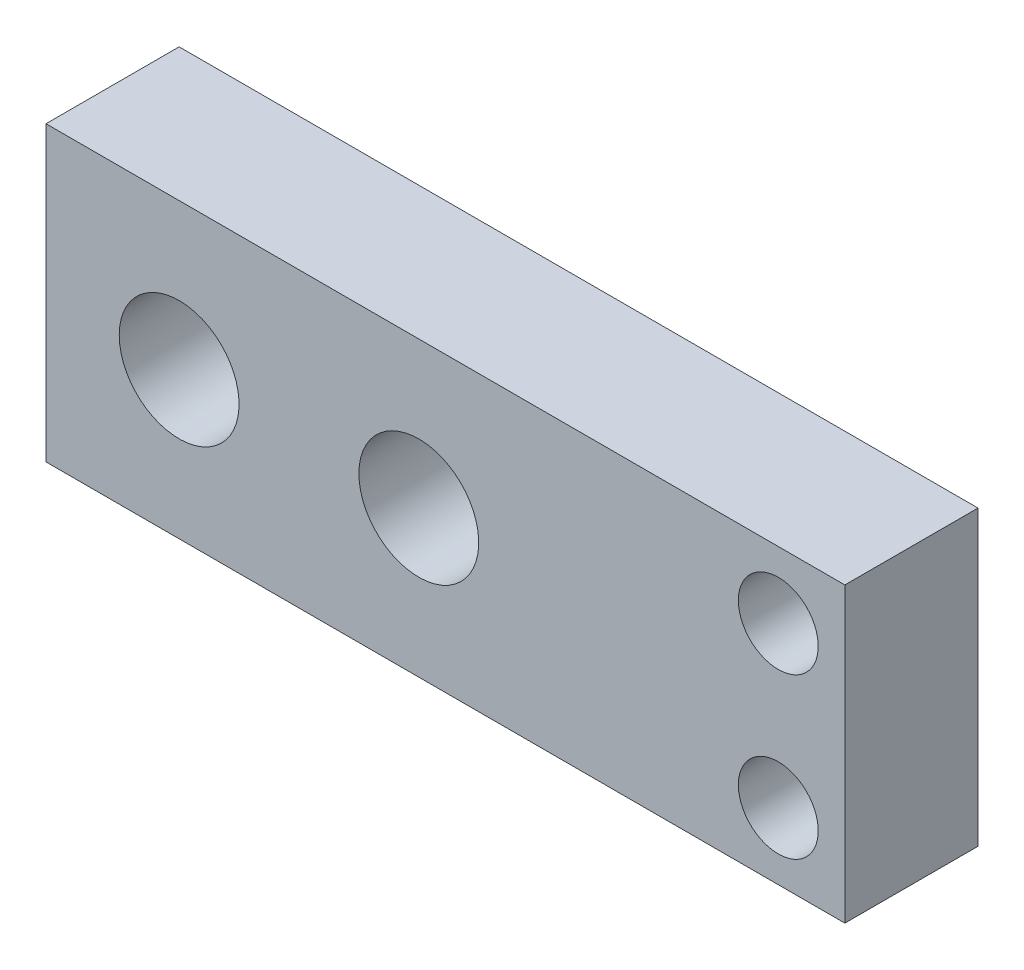
ISO-10303-21;
HEADER;
FILE_DESCRIPTION(('STEP AP214'),'2;1');
FILE_NAME('part.step','',(''),(''),'','','');
FILE_SCHEMA(('AUTOMOTIVE_DESIGN { 1 0 10303 214 1 1 1 1 }'));
ENDSEC;
DATA;
#1=APPLICATION_CONTEXT('core data for automotive mechanical design processes');
#2=APPLICATION_PROTOCOL_DEFINITION('international standard','automotive_design',2000,#1);
#3=PRODUCT_CONTEXT('',#1,'mechanical');
#4=PRODUCT('Part','Part','',(#3));
#5=PRODUCT_RELATED_PRODUCT_CATEGORY('part','',(#4));
#6=PRODUCT_DEFINITION_FORMATION('','',#4);
#7=PRODUCT_DEFINITION_CONTEXT('part definition',#1,'design');
#8=PRODUCT_DEFINITION('design','',#6,#7);
#9=PRODUCT_DEFINITION_SHAPE('','',#8);
#10=(LENGTH_UNIT() NAMED_UNIT(*) SI_UNIT(.MILLI.,.METRE.));
#11=(NAMED_UNIT(*) PLANE_ANGLE_UNIT() SI_UNIT($,.RADIAN.));
#12=(NAMED_UNIT(*) SI_UNIT($,.STERADIAN.) SOLID_ANGLE_UNIT());
#13=UNCERTAINTY_MEASURE_WITH_UNIT(LENGTH_MEASURE(1.E-05),#10,'distance_accuracy_value','');
#14=(GEOMETRIC_REPRESENTATION_CONTEXT(3) GLOBAL_UNCERTAINTY_ASSIGNED_CONTEXT((#13)) GLOBAL_UNIT_ASSIGNED_CONTEXT((#10,
#11,#12)) REPRESENTATION_CONTEXT('',''));
#15=CARTESIAN_POINT('',(0.,0.,0.));
#16=DIRECTION('',(0.,0.,1.));
#17=DIRECTION('',(1.,0.,0.));
#18=AXIS2_PLACEMENT_3D('',#15,#16,#17);
#19=CARTESIAN_POINT('',(30.,-11.,10.));
#20=DIRECTION('',(-1.,0.,0.));
#21=DIRECTION('',(0.,0.,1.));
#22=AXIS2_PLACEMENT_3D('',#19,#20,#21);
#23=PLANE('',#22);
#24=DIRECTION('',(0.,1.,0.));
#25=VECTOR('',#24,1.);
#26=CARTESIAN_POINT('',(30.,-11.,0.));
#27=LINE('',#26,#25);
#28=CARTESIAN_POINT('',(30.,-11.,0.));
#29=VERTEX_POINT('',#28);
#30=CARTESIAN_POINT('',(30.,11.,0.));
#31=VERTEX_POINT('',#30);
#32=EDGE_CURVE('E95',#29,#31,#27,.T.);
#33=ORIENTED_EDGE('',*,*,#32,.T.);
#34=DIRECTION('',(0.,0.,-1.));
#35=VECTOR('',#34,1.);
#36=CARTESIAN_POINT('',(30.,11.,10.));
#37=LINE('',#36,#35);
#38=CARTESIAN_POINT('',(30.,11.,10.));
#39=VERTEX_POINT('',#38);
#40=EDGE_CURVE('E11',#39,#31,#37,.T.);
#41=ORIENTED_EDGE('',*,*,#40,.F.);
#42=DIRECTION('',(0.,1.,0.));
#43=VECTOR('',#42,1.);
#44=CARTESIAN_POINT('',(30.,-11.,10.));
#45=LINE('',#44,#43);
#46=CARTESIAN_POINT('',(30.,-11.,10.));
#47=VERTEX_POINT('',#46);
#48=EDGE_CURVE('E83',#47,#39,#45,.T.);
#49=ORIENTED_EDGE('',*,*,#48,.F.);
#50=DIRECTION('',(0.,0.,-1.));
#51=VECTOR('',#50,1.);
#52=CARTESIAN_POINT('',(30.,-11.,10.));
#53=LINE('',#52,#51);
#54=EDGE_CURVE('E91',#47,#29,#53,.T.);
#55=ORIENTED_EDGE('',*,*,#54,.T.);
#56=EDGE_LOOP('',(#33,#41,#49,#55));
#57=FACE_BOUND('',#56,.T.);
#58=ADVANCED_FACE('F32',(#57),#23,.F.);
#59=CARTESIAN_POINT('',(-30.,11.,10.));
#60=DIRECTION('',(0.,-1.,0.));
#61=DIRECTION('',(0.,0.,-1.));
#62=AXIS2_PLACEMENT_3D('',#59,#60,#61);
#63=PLANE('',#62);
#64=DIRECTION('',(-1.,0.,0.));
#65=VECTOR('',#64,1.);
#66=CARTESIAN_POINT('',(-30.,11.,0.));
#67=LINE('',#66,#65);
#68=CARTESIAN_POINT('',(-30.,11.,0.));
#69=VERTEX_POINT('',#68);
#70=EDGE_CURVE('E87',#31,#69,#67,.T.);
#71=ORIENTED_EDGE('',*,*,#70,.T.);
#72=DIRECTION('',(0.,0.,-1.));
#73=VECTOR('',#72,1.);
#74=CARTESIAN_POINT('',(-30.,11.,10.));
#75=LINE('',#74,#73);
#76=CARTESIAN_POINT('',(-30.,11.,10.));
#77=VERTEX_POINT('',#76);
#78=EDGE_CURVE('E40',#77,#69,#75,.T.);
#79=ORIENTED_EDGE('',*,*,#78,.F.);
#80=DIRECTION('',(-1.,0.,0.));
#81=VECTOR('',#80,1.);
#82=CARTESIAN_POINT('',(-30.,11.,10.));
#83=LINE('',#82,#81);
#84=EDGE_CURVE('E78',#39,#77,#83,.T.);
#85=ORIENTED_EDGE('',*,*,#84,.F.);
#86=ORIENTED_EDGE('',*,*,#40,.T.);
#87=EDGE_LOOP('',(#71,#79,#85,#86));
#88=FACE_BOUND('',#87,.T.);
#89=ADVANCED_FACE('F86',(#88),#63,.F.);
#90=CARTESIAN_POINT('',(-30.,-11.,10.));
#91=DIRECTION('',(1.,0.,0.));
#92=DIRECTION('',(0.,0.,-1.));
#93=AXIS2_PLACEMENT_3D('',#90,#91,#92);
#94=PLANE('',#93);
#95=DIRECTION('',(0.,-1.,0.));
#96=VECTOR('',#95,1.);
#97=CARTESIAN_POINT('',(-30.,-11.,0.));
#98=LINE('',#97,#96);
#99=CARTESIAN_POINT('',(-30.,-11.,0.));
#100=VERTEX_POINT('',#99);
#101=EDGE_CURVE('E65',#69,#100,#98,.T.);
#102=ORIENTED_EDGE('',*,*,#101,.T.);
#103=DIRECTION('',(0.,0.,-1.));
#104=VECTOR('',#103,1.);
#105=CARTESIAN_POINT('',(-30.,-11.,10.));
#106=LINE('',#105,#104);
#107=CARTESIAN_POINT('',(-30.,-11.,10.));
#108=VERTEX_POINT('',#107);
#109=EDGE_CURVE('E88',#108,#100,#106,.T.);
#110=ORIENTED_EDGE('',*,*,#109,.F.);
#111=DIRECTION('',(0.,-1.,0.));
#112=VECTOR('',#111,1.);
#113=CARTESIAN_POINT('',(-30.,-11.,10.));
#114=LINE('',#113,#112);
#115=EDGE_CURVE('E81',#77,#108,#114,.T.);
#116=ORIENTED_EDGE('',*,*,#115,.F.);
#117=ORIENTED_EDGE('',*,*,#78,.T.);
#118=EDGE_LOOP('',(#102,#110,#116,#117));
#119=FACE_BOUND('',#118,.T.);
#120=ADVANCED_FACE('F89',(#119),#94,.F.);
#121=CARTESIAN_POINT('',(-30.,-11.,10.));
#122=DIRECTION('',(0.,1.,0.));
#123=DIRECTION('',(0.,0.,1.));
#124=AXIS2_PLACEMENT_3D('',#121,#122,#123);
#125=PLANE('',#124);
#126=DIRECTION('',(1.,0.,0.));
#127=VECTOR('',#126,1.);
#128=CARTESIAN_POINT('',(-30.,-11.,0.));
#129=LINE('',#128,#127);
#130=EDGE_CURVE('E71',#100,#29,#129,.T.);
#131=ORIENTED_EDGE('',*,*,#130,.T.);
#132=ORIENTED_EDGE('',*,*,#54,.F.);
#133=DIRECTION('',(1.,0.,0.));
#134=VECTOR('',#133,1.);
#135=CARTESIAN_POINT('',(-30.,-11.,10.));
#136=LINE('',#135,#134);
#137=EDGE_CURVE('E48',#108,#47,#136,.T.);
#138=ORIENTED_EDGE('',*,*,#137,.F.);
#139=ORIENTED_EDGE('',*,*,#109,.T.);
#140=EDGE_LOOP('',(#131,#132,#138,#139));
#141=FACE_BOUND('',#140,.T.);
#142=ADVANCED_FACE('F103',(#141),#125,.F.);
#143=CARTESIAN_POINT('',(0.,0.,10.));
#144=DIRECTION('',(0.,0.,-1.));
#145=DIRECTION('',(-1.,0.,0.));
#146=AXIS2_PLACEMENT_3D('',#143,#144,#145);
#147=PLANE('',#146);
#148=CARTESIAN_POINT('',(25.,-6.,10.));
#149=DIRECTION('',(0.,0.,-1.));
#150=DIRECTION('',(-1.,0.,0.));
#151=AXIS2_PLACEMENT_3D('',#148,#149,#150);
#152=CIRCLE('',#151,3.);
#153=CARTESIAN_POINT('',(22.,-6.,10.));
#154=VERTEX_POINT('',#153);
#155=EDGE_CURVE('E126',#154,#154,#152,.T.);
#156=ORIENTED_EDGE('',*,*,#155,.T.);
#157=EDGE_LOOP('',(#156));
#158=FACE_BOUND('',#157,.T.);
#159=CARTESIAN_POINT('',(25.,6.,10.));
#160=DIRECTION('',(0.,0.,-1.));
#161=DIRECTION('',(-1.,0.,0.));
#162=AXIS2_PLACEMENT_3D('',#159,#160,#161);
#163=CIRCLE('',#162,3.);
#164=CARTESIAN_POINT('',(22.,6.,10.));
#165=VERTEX_POINT('',#164);
#166=EDGE_CURVE('E120',#165,#165,#163,.T.);
#167=ORIENTED_EDGE('',*,*,#166,.T.);
#168=EDGE_LOOP('',(#167));
#169=FACE_BOUND('',#168,.T.);
#170=CARTESIAN_POINT('',(-1.99999999999999,0.,10.));
#171=DIRECTION('',(0.,0.,-1.));
#172=DIRECTION('',(-1.,0.,0.));
#173=AXIS2_PLACEMENT_3D('',#170,#171,#172);
#174=CIRCLE('',#173,4.5);
#175=CARTESIAN_POINT('',(-6.49999999999999,0.,10.));
#176=VERTEX_POINT('',#175);
#177=EDGE_CURVE('E114',#176,#176,#174,.T.);
#178=ORIENTED_EDGE('',*,*,#177,.T.);
#179=EDGE_LOOP('',(#178));
#180=FACE_BOUND('',#179,.T.);
#181=CARTESIAN_POINT('',(-20.,0.,10.));
#182=DIRECTION('',(0.,0.,-1.));
#183=DIRECTION('',(-1.,0.,0.));
#184=AXIS2_PLACEMENT_3D('',#181,#182,#183);
#185=CIRCLE('',#184,4.5);
#186=CARTESIAN_POINT('',(-24.5,0.,10.));
#187=VERTEX_POINT('',#186);
#188=EDGE_CURVE('E98',#187,#187,#185,.T.);
#189=ORIENTED_EDGE('',*,*,#188,.T.);
#190=EDGE_LOOP('',(#189));
#191=FACE_BOUND('',#190,.T.);
#192=ORIENTED_EDGE('',*,*,#48,.T.);
#193=ORIENTED_EDGE('',*,*,#84,.T.);
#194=ORIENTED_EDGE('',*,*,#115,.T.);
#195=ORIENTED_EDGE('',*,*,#137,.T.);
#196=EDGE_LOOP('',(#192,#193,#194,#195));
#197=FACE_BOUND('',#196,.T.);
#198=ADVANCED_FACE('F79',(#158,#169,#180,#191,#197),#147,.F.);
#199=CARTESIAN_POINT('',(0.,0.,0.));
#200=DIRECTION('',(0.,0.,-1.));
#201=DIRECTION('',(-1.,0.,0.));
#202=AXIS2_PLACEMENT_3D('',#199,#200,#201);
#203=PLANE('',#202);
#204=CARTESIAN_POINT('',(25.,-6.,0.));
#205=DIRECTION('',(0.,0.,-1.));
#206=DIRECTION('',(-1.,0.,0.));
#207=AXIS2_PLACEMENT_3D('',#204,#205,#206);
#208=CIRCLE('',#207,3.);
#209=CARTESIAN_POINT('',(22.,-6.,0.));
#210=VERTEX_POINT('',#209);
#211=EDGE_CURVE('E129',#210,#210,#208,.T.);
#212=ORIENTED_EDGE('',*,*,#211,.F.);
#213=EDGE_LOOP('',(#212));
#214=FACE_BOUND('',#213,.T.);
#215=CARTESIAN_POINT('',(25.,6.,0.));
#216=DIRECTION('',(0.,0.,-1.));
#217=DIRECTION('',(-1.,0.,0.));
#218=AXIS2_PLACEMENT_3D('',#215,#216,#217);
#219=CIRCLE('',#218,3.);
#220=CARTESIAN_POINT('',(22.,6.,0.));
#221=VERTEX_POINT('',#220);
#222=EDGE_CURVE('E123',#221,#221,#219,.T.);
#223=ORIENTED_EDGE('',*,*,#222,.F.);
#224=EDGE_LOOP('',(#223));
#225=FACE_BOUND('',#224,.T.);
#226=CARTESIAN_POINT('',(-1.99999999999999,0.,0.));
#227=DIRECTION('',(0.,0.,-1.));
#228=DIRECTION('',(-1.,0.,0.));
#229=AXIS2_PLACEMENT_3D('',#226,#227,#228);
#230=CIRCLE('',#229,4.5);
#231=CARTESIAN_POINT('',(-6.49999999999999,0.,0.));
#232=VERTEX_POINT('',#231);
#233=EDGE_CURVE('E117',#232,#232,#230,.T.);
#234=ORIENTED_EDGE('',*,*,#233,.F.);
#235=EDGE_LOOP('',(#234));
#236=FACE_BOUND('',#235,.T.);
#237=CARTESIAN_POINT('',(-20.,0.,0.));
#238=DIRECTION('',(0.,0.,-1.));
#239=DIRECTION('',(-1.,0.,0.));
#240=AXIS2_PLACEMENT_3D('',#237,#238,#239);
#241=CIRCLE('',#240,4.5);
#242=CARTESIAN_POINT('',(-24.5,0.,0.));
#243=VERTEX_POINT('',#242);
#244=EDGE_CURVE('E111',#243,#243,#241,.T.);
#245=ORIENTED_EDGE('',*,*,#244,.F.);
#246=EDGE_LOOP('',(#245));
#247=FACE_BOUND('',#246,.T.);
#248=ORIENTED_EDGE('',*,*,#32,.F.);
#249=ORIENTED_EDGE('',*,*,#130,.F.);
#250=ORIENTED_EDGE('',*,*,#101,.F.);
#251=ORIENTED_EDGE('',*,*,#70,.F.);
#252=EDGE_LOOP('',(#248,#249,#250,#251));
#253=FACE_BOUND('',#252,.T.);
#254=ADVANCED_FACE('F106',(#214,#225,#236,#247,#253),#203,.T.);
#255=CARTESIAN_POINT('',(-20.,0.,60.));
#256=DIRECTION('',(0.,0.,-1.));
#257=DIRECTION('',(-1.,0.,0.));
#258=AXIS2_PLACEMENT_3D('',#255,#256,#257);
#259=CYLINDRICAL_SURFACE('',#258,4.5);
#260=ORIENTED_EDGE('',*,*,#244,.T.);
#261=EDGE_LOOP('',(#260));
#262=FACE_BOUND('',#261,.T.);
#263=ORIENTED_EDGE('',*,*,#188,.F.);
#264=EDGE_LOOP('',(#263));
#265=FACE_BOUND('',#264,.T.);
#266=ADVANCED_FACE('F138',(#262,#265),#259,.F.);
#267=CARTESIAN_POINT('',(-1.99999999999999,0.,60.));
#268=DIRECTION('',(0.,0.,-1.));
#269=DIRECTION('',(-1.,0.,0.));
#270=AXIS2_PLACEMENT_3D('',#267,#268,#269);
#271=CYLINDRICAL_SURFACE('',#270,4.5);
#272=ORIENTED_EDGE('',*,*,#233,.T.);
#273=EDGE_LOOP('',(#272));
#274=FACE_BOUND('',#273,.T.);
#275=ORIENTED_EDGE('',*,*,#177,.F.);
#276=EDGE_LOOP('',(#275));
#277=FACE_BOUND('',#276,.T.);
#278=ADVANCED_FACE('F148',(#274,#277),#271,.F.);
#279=CARTESIAN_POINT('',(25.,6.,60.));
#280=DIRECTION('',(0.,0.,-1.));
#281=DIRECTION('',(-1.,0.,0.));
#282=AXIS2_PLACEMENT_3D('',#279,#280,#281);
#283=CYLINDRICAL_SURFACE('',#282,3.);
#284=ORIENTED_EDGE('',*,*,#222,.T.);
#285=EDGE_LOOP('',(#284));
#286=FACE_BOUND('',#285,.T.);
#287=ORIENTED_EDGE('',*,*,#166,.F.);
#288=EDGE_LOOP('',(#287));
#289=FACE_BOUND('',#288,.T.);
#290=ADVANCED_FACE('F190',(#286,#289),#283,.F.);
#291=CARTESIAN_POINT('',(25.,-6.,60.));
#292=DIRECTION('',(0.,0.,-1.));
#293=DIRECTION('',(-1.,0.,0.));
#294=AXIS2_PLACEMENT_3D('',#291,#292,#293);
#295=CYLINDRICAL_SURFACE('',#294,3.);
#296=ORIENTED_EDGE('',*,*,#211,.T.);
#297=EDGE_LOOP('',(#296));
#298=FACE_BOUND('',#297,.T.);
#299=ORIENTED_EDGE('',*,*,#155,.F.);
#300=EDGE_LOOP('',(#299));
#301=FACE_BOUND('',#300,.T.);
#302=ADVANCED_FACE('F133',(#298,#301),#295,.F.);
#303=CLOSED_SHELL('',(#58,#89,#120,#142,#198,#254,#266,#278,#290,#302));
#304=MANIFOLD_SOLID_BREP('B2',#303);
#305=ADVANCED_BREP_SHAPE_REPRESENTATION('',(#18,#304),#14);
#306=SHAPE_DEFINITION_REPRESENTATION(#9,#305);
ENDSEC;
END-ISO-10303-21;
